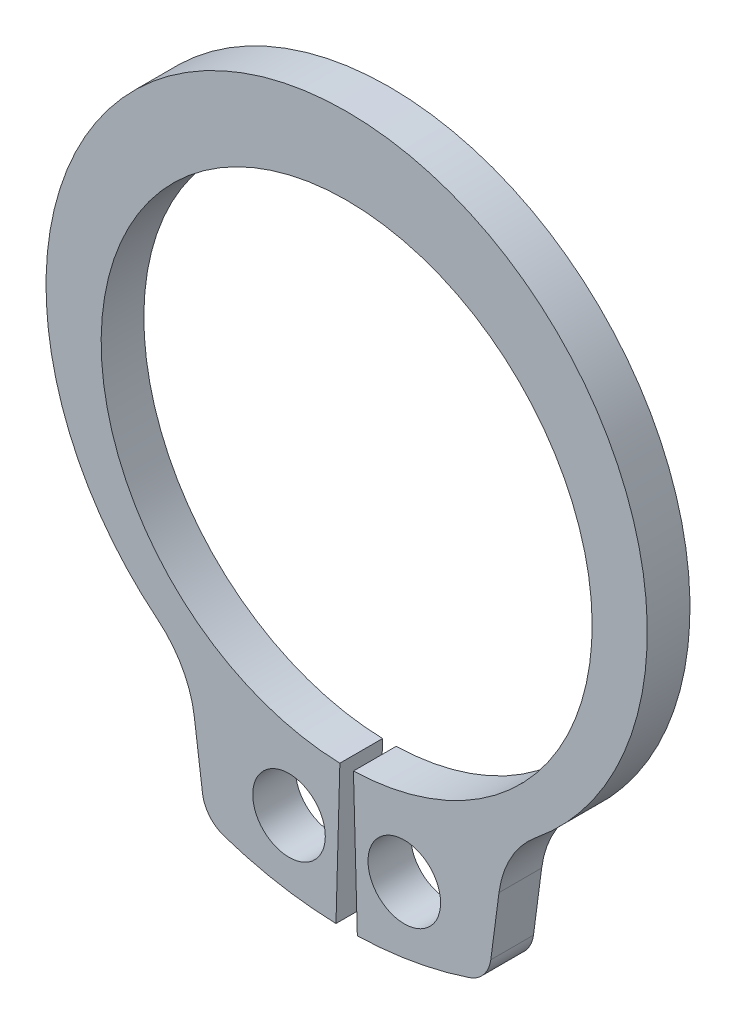
ISO-10303-21;
HEADER;
FILE_DESCRIPTION(('STEP AP214'),'2;1');
FILE_NAME('part.step','',(''),(''),'','','');
FILE_SCHEMA(('AUTOMOTIVE_DESIGN { 1 0 10303 214 1 1 1 1 }'));
ENDSEC;
DATA;
#1=APPLICATION_CONTEXT('core data for automotive mechanical design processes');
#2=APPLICATION_PROTOCOL_DEFINITION('international standard','automotive_design',2000,#1);
#3=PRODUCT_CONTEXT('',#1,'mechanical');
#4=PRODUCT('Part','Part','',(#3));
#5=PRODUCT_RELATED_PRODUCT_CATEGORY('part','',(#4));
#6=PRODUCT_DEFINITION_FORMATION('','',#4);
#7=PRODUCT_DEFINITION_CONTEXT('part definition',#1,'design');
#8=PRODUCT_DEFINITION('design','',#6,#7);
#9=PRODUCT_DEFINITION_SHAPE('','',#8);
#10=(LENGTH_UNIT() NAMED_UNIT(*) SI_UNIT(.MILLI.,.METRE.));
#11=(NAMED_UNIT(*) PLANE_ANGLE_UNIT() SI_UNIT($,.RADIAN.));
#12=(NAMED_UNIT(*) SI_UNIT($,.STERADIAN.) SOLID_ANGLE_UNIT());
#13=UNCERTAINTY_MEASURE_WITH_UNIT(LENGTH_MEASURE(1.E-05),#10,'distance_accuracy_value','');
#14=(GEOMETRIC_REPRESENTATION_CONTEXT(3) GLOBAL_UNCERTAINTY_ASSIGNED_CONTEXT((#13)) GLOBAL_UNIT_ASSIGNED_CONTEXT((#10,
#11,#12)) REPRESENTATION_CONTEXT('',''));
#15=CARTESIAN_POINT('',(0.,0.,0.));
#16=DIRECTION('',(0.,0.,1.));
#17=DIRECTION('',(1.,0.,0.));
#18=AXIS2_PLACEMENT_3D('',#15,#16,#17);
#19=CARTESIAN_POINT('',(0.,0.,-1.));
#20=DIRECTION('',(0.,0.,1.));
#21=DIRECTION('',(1.,0.,0.));
#22=AXIS2_PLACEMENT_3D('',#19,#20,#21);
#23=CYLINDRICAL_SURFACE('',#22,5.75);
#24=CARTESIAN_POINT('',(0.,0.,0.));
#25=DIRECTION('',(0.,0.,-1.));
#26=DIRECTION('',(1.,0.,0.));
#27=AXIS2_PLACEMENT_3D('',#24,#25,#26);
#28=CIRCLE('',#27,5.75);
#29=CARTESIAN_POINT('',(-0.158839779005525,-5.74780566169434,0.));
#30=VERTEX_POINT('',#29);
#31=CARTESIAN_POINT('',(0.158839779005525,-5.74780566169434,0.));
#32=VERTEX_POINT('',#31);
#33=EDGE_CURVE('E154',#30,#32,#28,.T.);
#34=ORIENTED_EDGE('',*,*,#33,.F.);
#35=DIRECTION('',(0.,0.,1.));
#36=VECTOR('',#35,1.);
#37=CARTESIAN_POINT('',(-0.158839779005525,-5.74780566169434,-1.));
#38=LINE('',#37,#36);
#39=CARTESIAN_POINT('',(-0.158839779005525,-5.74780566169434,-1.));
#40=VERTEX_POINT('',#39);
#41=EDGE_CURVE('E11',#40,#30,#38,.T.);
#42=ORIENTED_EDGE('',*,*,#41,.F.);
#43=CARTESIAN_POINT('',(0.,0.,-1.));
#44=DIRECTION('',(0.,0.,-1.));
#45=DIRECTION('',(1.,0.,0.));
#46=AXIS2_PLACEMENT_3D('',#43,#44,#45);
#47=CIRCLE('',#46,5.75);
#48=CARTESIAN_POINT('',(0.158839779005525,-5.74780566169434,-1.));
#49=VERTEX_POINT('',#48);
#50=EDGE_CURVE('E187',#40,#49,#47,.T.);
#51=ORIENTED_EDGE('',*,*,#50,.T.);
#52=DIRECTION('',(0.,0.,1.));
#53=VECTOR('',#52,1.);
#54=CARTESIAN_POINT('',(0.158839779005525,-5.74780566169434,-1.));
#55=LINE('',#54,#53);
#56=EDGE_CURVE('E36',#49,#32,#55,.T.);
#57=ORIENTED_EDGE('',*,*,#56,.T.);
#58=EDGE_LOOP('',(#34,#42,#51,#57));
#59=FACE_BOUND('',#58,.T.);
#60=ADVANCED_FACE('F33',(#59),#23,.F.);
#61=CARTESIAN_POINT('',(-0.158839779005525,-5.74780566169434,-1.));
#62=DIRECTION('',(0.999618375946841,-0.0276243093922652,0.));
#63=DIRECTION('',(0.0276243093922652,0.999618375946841,0.));
#64=AXIS2_PLACEMENT_3D('',#61,#62,#63);
#65=PLANE('',#64);
#66=DIRECTION('',(0.0276243093922652,0.999618375946841,0.));
#67=VECTOR('',#66,1.);
#68=CARTESIAN_POINT('',(-0.158839779005525,-5.74780566169434,0.));
#69=LINE('',#68,#67);
#70=CARTESIAN_POINT('',(-0.25,-9.04654630231891,0.));
#71=VERTEX_POINT('',#70);
#72=EDGE_CURVE('E185',#71,#30,#69,.T.);
#73=ORIENTED_EDGE('',*,*,#72,.F.);
#74=DIRECTION('',(0.,0.,1.));
#75=VECTOR('',#74,1.);
#76=CARTESIAN_POINT('',(-0.25,-9.04654630231891,-1.));
#77=LINE('',#76,#75);
#78=CARTESIAN_POINT('',(-0.25,-9.04654630231891,-1.));
#79=VERTEX_POINT('',#78);
#80=EDGE_CURVE('E42',#79,#71,#77,.T.);
#81=ORIENTED_EDGE('',*,*,#80,.F.);
#82=DIRECTION('',(0.0276243093922652,0.999618375946841,0.));
#83=VECTOR('',#82,1.);
#84=CARTESIAN_POINT('',(-0.158839779005525,-5.74780566169434,-1.));
#85=LINE('',#84,#83);
#86=EDGE_CURVE('E144',#79,#40,#85,.T.);
#87=ORIENTED_EDGE('',*,*,#86,.T.);
#88=ORIENTED_EDGE('',*,*,#41,.T.);
#89=EDGE_LOOP('',(#73,#81,#87,#88));
#90=FACE_BOUND('',#89,.T.);
#91=ADVANCED_FACE('F207',(#90),#65,.T.);
#92=CARTESIAN_POINT('',(0.,0.,-1.));
#93=DIRECTION('',(0.,0.,1.));
#94=DIRECTION('',(1.,0.,0.));
#95=AXIS2_PLACEMENT_3D('',#92,#93,#94);
#96=CYLINDRICAL_SURFACE('',#95,9.05);
#97=CARTESIAN_POINT('',(0.,0.,0.));
#98=DIRECTION('',(0.,0.,1.));
#99=DIRECTION('',(1.,0.,0.));
#100=AXIS2_PLACEMENT_3D('',#97,#98,#99);
#101=CIRCLE('',#100,9.05);
#102=CARTESIAN_POINT('',(-2.87007776682859,-8.5828406493629,0.));
#103=VERTEX_POINT('',#102);
#104=EDGE_CURVE('E131',#103,#71,#101,.T.);
#105=ORIENTED_EDGE('',*,*,#104,.F.);
#106=DIRECTION('',(0.,0.,1.));
#107=VECTOR('',#106,1.);
#108=CARTESIAN_POINT('',(-2.87007776682859,-8.5828406493629,-1.));
#109=LINE('',#108,#107);
#110=CARTESIAN_POINT('',(-2.87007776682859,-8.5828406493629,-1.));
#111=VERTEX_POINT('',#110);
#112=EDGE_CURVE('E126',#111,#103,#109,.T.);
#113=ORIENTED_EDGE('',*,*,#112,.F.);
#114=CARTESIAN_POINT('',(0.,0.,-1.));
#115=DIRECTION('',(0.,0.,1.));
#116=DIRECTION('',(1.,0.,0.));
#117=AXIS2_PLACEMENT_3D('',#114,#115,#116);
#118=CIRCLE('',#117,9.05);
#119=EDGE_CURVE('E129',#111,#79,#118,.T.);
#120=ORIENTED_EDGE('',*,*,#119,.T.);
#121=ORIENTED_EDGE('',*,*,#80,.T.);
#122=EDGE_LOOP('',(#105,#113,#120,#121));
#123=FACE_BOUND('',#122,.T.);
#124=ADVANCED_FACE('F128',(#123),#96,.T.);
#125=CARTESIAN_POINT('',(-2.63222601819639,-7.87155551267537,-1.));
#126=DIRECTION('',(0.,0.,1.));
#127=DIRECTION('',(1.,0.,0.));
#128=AXIS2_PLACEMENT_3D('',#125,#126,#127);
#129=CYLINDRICAL_SURFACE('',#128,0.749999999999999);
#130=CARTESIAN_POINT('',(-2.63222601819639,-7.87155551267537,0.));
#131=DIRECTION('',(0.,0.,1.));
#132=DIRECTION('',(1.,0.,0.));
#133=AXIS2_PLACEMENT_3D('',#130,#131,#132);
#134=CIRCLE('',#133,0.749999999999999);
#135=CARTESIAN_POINT('',(-3.37580966422674,-7.96945015684041,0.));
#136=VERTEX_POINT('',#135);
#137=EDGE_CURVE('E182',#136,#103,#134,.T.);
#138=ORIENTED_EDGE('',*,*,#137,.F.);
#139=DIRECTION('',(0.,0.,1.));
#140=VECTOR('',#139,1.);
#141=CARTESIAN_POINT('',(-3.37580966422674,-7.96945015684041,-1.));
#142=LINE('',#141,#140);
#143=CARTESIAN_POINT('',(-3.37580966422674,-7.96945015684041,-1.));
#144=VERTEX_POINT('',#143);
#145=EDGE_CURVE('E136',#144,#136,#142,.T.);
#146=ORIENTED_EDGE('',*,*,#145,.F.);
#147=CARTESIAN_POINT('',(-2.63222601819639,-7.87155551267537,-1.));
#148=DIRECTION('',(0.,0.,1.));
#149=DIRECTION('',(1.,0.,0.));
#150=AXIS2_PLACEMENT_3D('',#147,#148,#149);
#151=CIRCLE('',#150,0.749999999999999);
#152=EDGE_CURVE('E142',#144,#111,#151,.T.);
#153=ORIENTED_EDGE('',*,*,#152,.T.);
#154=ORIENTED_EDGE('',*,*,#112,.T.);
#155=EDGE_LOOP('',(#138,#146,#153,#154));
#156=FACE_BOUND('',#155,.T.);
#157=ADVANCED_FACE('F146',(#156),#129,.T.);
#158=CARTESIAN_POINT('',(-3.56793709135462,-6.51009746206657,-1.));
#159=DIRECTION('',(-0.99144486137381,-0.130526192220052,0.));
#160=DIRECTION('',(0.130526192220052,-0.99144486137381,0.));
#161=AXIS2_PLACEMENT_3D('',#158,#159,#160);
#162=PLANE('',#161);
#163=DIRECTION('',(0.130526192220052,-0.99144486137381,0.));
#164=VECTOR('',#163,1.);
#165=CARTESIAN_POINT('',(-3.56793709135462,-6.51009746206657,0.));
#166=LINE('',#165,#164);
#167=CARTESIAN_POINT('',(-3.56793709135462,-6.51009746206657,0.));
#168=VERTEX_POINT('',#167);
#169=EDGE_CURVE('E179',#168,#136,#166,.T.);
#170=ORIENTED_EDGE('',*,*,#169,.F.);
#171=DIRECTION('',(0.,0.,1.));
#172=VECTOR('',#171,1.);
#173=CARTESIAN_POINT('',(-3.56793709135462,-6.51009746206657,-1.));
#174=LINE('',#173,#172);
#175=CARTESIAN_POINT('',(-3.56793709135462,-6.51009746206657,-1.));
#176=VERTEX_POINT('',#175);
#177=EDGE_CURVE('E191',#176,#168,#174,.T.);
#178=ORIENTED_EDGE('',*,*,#177,.F.);
#179=DIRECTION('',(0.130526192220052,-0.99144486137381,0.));
#180=VECTOR('',#179,1.);
#181=CARTESIAN_POINT('',(-3.56793709135462,-6.51009746206657,-1.));
#182=LINE('',#181,#180);
#183=EDGE_CURVE('E147',#176,#144,#182,.T.);
#184=ORIENTED_EDGE('',*,*,#183,.T.);
#185=ORIENTED_EDGE('',*,*,#145,.T.);
#186=EDGE_LOOP('',(#170,#178,#184,#185));
#187=FACE_BOUND('',#186,.T.);
#188=ADVANCED_FACE('F220',(#187),#162,.T.);
#189=CARTESIAN_POINT('',(-5.94540544054401,-6.82309710817233,-1.));
#190=DIRECTION('',(0.,0.,1.));
#191=DIRECTION('',(1.,0.,0.));
#192=AXIS2_PLACEMENT_3D('',#189,#190,#191);
#193=CYLINDRICAL_SURFACE('',#192,2.39798342985511);
#194=CARTESIAN_POINT('',(-5.94540544054401,-6.82309710817233,0.));
#195=DIRECTION('',(0.,0.,-1.));
#196=DIRECTION('',(1.,0.,0.));
#197=AXIS2_PLACEMENT_3D('',#194,#195,#196);
#198=CIRCLE('',#197,2.39798342985511);
#199=CARTESIAN_POINT('',(-4.43503151096838,-4.96054640477714,0.));
#200=VERTEX_POINT('',#199);
#201=EDGE_CURVE('E176',#200,#168,#198,.T.);
#202=ORIENTED_EDGE('',*,*,#201,.F.);
#203=DIRECTION('',(0.,0.,1.));
#204=VECTOR('',#203,1.);
#205=CARTESIAN_POINT('',(-4.43503151096838,-4.96054640477714,-1.));
#206=LINE('',#205,#204);
#207=CARTESIAN_POINT('',(-4.43503151096838,-4.96054640477714,-1.));
#208=VERTEX_POINT('',#207);
#209=EDGE_CURVE('E193',#208,#200,#206,.T.);
#210=ORIENTED_EDGE('',*,*,#209,.F.);
#211=CARTESIAN_POINT('',(-5.94540544054401,-6.82309710817233,-1.));
#212=DIRECTION('',(0.,0.,-1.));
#213=DIRECTION('',(1.,0.,0.));
#214=AXIS2_PLACEMENT_3D('',#211,#212,#213);
#215=CIRCLE('',#214,2.39798342985511);
#216=EDGE_CURVE('E149',#208,#176,#215,.T.);
#217=ORIENTED_EDGE('',*,*,#216,.T.);
#218=ORIENTED_EDGE('',*,*,#177,.T.);
#219=EDGE_LOOP('',(#202,#210,#217,#218));
#220=FACE_BOUND('',#219,.T.);
#221=ADVANCED_FACE('F223',(#220),#193,.F.);
#222=CARTESIAN_POINT('',(0.,0.508609874062365,-1.));
#223=DIRECTION('',(0.,0.,1.));
#224=DIRECTION('',(1.,0.,0.));
#225=AXIS2_PLACEMENT_3D('',#222,#223,#224);
#226=CYLINDRICAL_SURFACE('',#225,7.04139012593764);
#227=CARTESIAN_POINT('',(0.,0.508609874062365,0.));
#228=DIRECTION('',(0.,0.,1.));
#229=DIRECTION('',(1.,0.,0.));
#230=AXIS2_PLACEMENT_3D('',#227,#228,#229);
#231=CIRCLE('',#230,7.04139012593764);
#232=CARTESIAN_POINT('',(4.43503151096838,-4.96054640477714,0.));
#233=VERTEX_POINT('',#232);
#234=EDGE_CURVE('E173',#233,#200,#231,.T.);
#235=ORIENTED_EDGE('',*,*,#234,.F.);
#236=DIRECTION('',(0.,0.,1.));
#237=VECTOR('',#236,1.);
#238=CARTESIAN_POINT('',(4.43503151096838,-4.96054640477714,-1.));
#239=LINE('',#238,#237);
#240=CARTESIAN_POINT('',(4.43503151096838,-4.96054640477714,-1.));
#241=VERTEX_POINT('',#240);
#242=EDGE_CURVE('E195',#241,#233,#239,.T.);
#243=ORIENTED_EDGE('',*,*,#242,.F.);
#244=CARTESIAN_POINT('',(0.,0.508609874062365,-1.));
#245=DIRECTION('',(0.,0.,1.));
#246=DIRECTION('',(1.,0.,0.));
#247=AXIS2_PLACEMENT_3D('',#244,#245,#246);
#248=CIRCLE('',#247,7.04139012593764);
#249=EDGE_CURVE('E297',#241,#208,#248,.T.);
#250=ORIENTED_EDGE('',*,*,#249,.T.);
#251=ORIENTED_EDGE('',*,*,#209,.T.);
#252=EDGE_LOOP('',(#235,#243,#250,#251));
#253=FACE_BOUND('',#252,.T.);
#254=ADVANCED_FACE('F227',(#253),#226,.T.);
#255=CARTESIAN_POINT('',(5.94540544054401,-6.82309710817233,-1.));
#256=DIRECTION('',(0.,0.,1.));
#257=DIRECTION('',(1.,0.,0.));
#258=AXIS2_PLACEMENT_3D('',#255,#256,#257);
#259=CYLINDRICAL_SURFACE('',#258,2.39798342985511);
#260=CARTESIAN_POINT('',(5.94540544054401,-6.82309710817233,0.));
#261=DIRECTION('',(0.,0.,-1.));
#262=DIRECTION('',(1.,0.,0.));
#263=AXIS2_PLACEMENT_3D('',#260,#261,#262);
#264=CIRCLE('',#263,2.39798342985511);
#265=CARTESIAN_POINT('',(3.56793709135462,-6.51009746206656,0.));
#266=VERTEX_POINT('',#265);
#267=EDGE_CURVE('E170',#266,#233,#264,.T.);
#268=ORIENTED_EDGE('',*,*,#267,.F.);
#269=DIRECTION('',(0.,0.,1.));
#270=VECTOR('',#269,1.);
#271=CARTESIAN_POINT('',(3.56793709135462,-6.51009746206656,-1.));
#272=LINE('',#271,#270);
#273=CARTESIAN_POINT('',(3.56793709135462,-6.51009746206656,-1.));
#274=VERTEX_POINT('',#273);
#275=EDGE_CURVE('E197',#274,#266,#272,.T.);
#276=ORIENTED_EDGE('',*,*,#275,.F.);
#277=CARTESIAN_POINT('',(5.94540544054401,-6.82309710817233,-1.));
#278=DIRECTION('',(0.,0.,-1.));
#279=DIRECTION('',(1.,0.,0.));
#280=AXIS2_PLACEMENT_3D('',#277,#278,#279);
#281=CIRCLE('',#280,2.39798342985511);
#282=EDGE_CURVE('E294',#274,#241,#281,.T.);
#283=ORIENTED_EDGE('',*,*,#282,.T.);
#284=ORIENTED_EDGE('',*,*,#242,.T.);
#285=EDGE_LOOP('',(#268,#276,#283,#284));
#286=FACE_BOUND('',#285,.T.);
#287=ADVANCED_FACE('F231',(#286),#259,.F.);
#288=CARTESIAN_POINT('',(3.56793709135462,-6.51009746206657,-1.));
#289=DIRECTION('',(0.99144486137381,-0.130526192220052,0.));
#290=DIRECTION('',(0.130526192220052,0.99144486137381,0.));
#291=AXIS2_PLACEMENT_3D('',#288,#289,#290);
#292=PLANE('',#291);
#293=DIRECTION('',(0.130526192220052,0.99144486137381,0.));
#294=VECTOR('',#293,1.);
#295=CARTESIAN_POINT('',(3.56793709135462,-6.51009746206657,0.));
#296=LINE('',#295,#294);
#297=CARTESIAN_POINT('',(3.37580966422674,-7.96945015684041,0.));
#298=VERTEX_POINT('',#297);
#299=EDGE_CURVE('E167',#298,#266,#296,.T.);
#300=ORIENTED_EDGE('',*,*,#299,.F.);
#301=DIRECTION('',(0.,0.,1.));
#302=VECTOR('',#301,1.);
#303=CARTESIAN_POINT('',(3.37580966422674,-7.96945015684041,-1.));
#304=LINE('',#303,#302);
#305=CARTESIAN_POINT('',(3.37580966422674,-7.96945015684041,-1.));
#306=VERTEX_POINT('',#305);
#307=EDGE_CURVE('E199',#306,#298,#304,.T.);
#308=ORIENTED_EDGE('',*,*,#307,.F.);
#309=DIRECTION('',(0.130526192220052,0.99144486137381,0.));
#310=VECTOR('',#309,1.);
#311=CARTESIAN_POINT('',(3.56793709135462,-6.51009746206657,-1.));
#312=LINE('',#311,#310);
#313=EDGE_CURVE('E291',#306,#274,#312,.T.);
#314=ORIENTED_EDGE('',*,*,#313,.T.);
#315=ORIENTED_EDGE('',*,*,#275,.T.);
#316=EDGE_LOOP('',(#300,#308,#314,#315));
#317=FACE_BOUND('',#316,.T.);
#318=ADVANCED_FACE('F235',(#317),#292,.T.);
#319=CARTESIAN_POINT('',(2.63222601819639,-7.87155551267537,-1.));
#320=DIRECTION('',(0.,0.,1.));
#321=DIRECTION('',(1.,0.,0.));
#322=AXIS2_PLACEMENT_3D('',#319,#320,#321);
#323=CYLINDRICAL_SURFACE('',#322,0.749999999999999);
#324=CARTESIAN_POINT('',(2.63222601819639,-7.87155551267537,0.));
#325=DIRECTION('',(0.,0.,1.));
#326=DIRECTION('',(-1.,0.,0.));
#327=AXIS2_PLACEMENT_3D('',#324,#325,#326);
#328=CIRCLE('',#327,0.749999999999999);
#329=CARTESIAN_POINT('',(2.87007776682859,-8.5828406493629,0.));
#330=VERTEX_POINT('',#329);
#331=EDGE_CURVE('E164',#330,#298,#328,.T.);
#332=ORIENTED_EDGE('',*,*,#331,.F.);
#333=DIRECTION('',(0.,0.,1.));
#334=VECTOR('',#333,1.);
#335=CARTESIAN_POINT('',(2.87007776682859,-8.5828406493629,-1.));
#336=LINE('',#335,#334);
#337=CARTESIAN_POINT('',(2.87007776682859,-8.5828406493629,-1.));
#338=VERTEX_POINT('',#337);
#339=EDGE_CURVE('E201',#338,#330,#336,.T.);
#340=ORIENTED_EDGE('',*,*,#339,.F.);
#341=CARTESIAN_POINT('',(2.63222601819639,-7.87155551267537,-1.));
#342=DIRECTION('',(0.,0.,1.));
#343=DIRECTION('',(-1.,0.,0.));
#344=AXIS2_PLACEMENT_3D('',#341,#342,#343);
#345=CIRCLE('',#344,0.749999999999999);
#346=EDGE_CURVE('E288',#338,#306,#345,.T.);
#347=ORIENTED_EDGE('',*,*,#346,.T.);
#348=ORIENTED_EDGE('',*,*,#307,.T.);
#349=EDGE_LOOP('',(#332,#340,#347,#348));
#350=FACE_BOUND('',#349,.T.);
#351=ADVANCED_FACE('F239',(#350),#323,.T.);
#352=CARTESIAN_POINT('',(0.,0.,-1.));
#353=DIRECTION('',(0.,0.,1.));
#354=DIRECTION('',(1.,0.,0.));
#355=AXIS2_PLACEMENT_3D('',#352,#353,#354);
#356=CYLINDRICAL_SURFACE('',#355,9.05);
#357=CARTESIAN_POINT('',(0.,0.,0.));
#358=DIRECTION('',(0.,0.,1.));
#359=DIRECTION('',(1.,0.,0.));
#360=AXIS2_PLACEMENT_3D('',#357,#358,#359);
#361=CIRCLE('',#360,9.05);
#362=CARTESIAN_POINT('',(0.249999999999998,-9.04654630231891,0.));
#363=VERTEX_POINT('',#362);
#364=EDGE_CURVE('E161',#363,#330,#361,.T.);
#365=ORIENTED_EDGE('',*,*,#364,.F.);
#366=DIRECTION('',(0.,0.,1.));
#367=VECTOR('',#366,1.);
#368=CARTESIAN_POINT('',(0.249999999999998,-9.04654630231891,-1.));
#369=LINE('',#368,#367);
#370=CARTESIAN_POINT('',(0.249999999999998,-9.04654630231891,-1.));
#371=VERTEX_POINT('',#370);
#372=EDGE_CURVE('E202',#371,#363,#369,.T.);
#373=ORIENTED_EDGE('',*,*,#372,.F.);
#374=CARTESIAN_POINT('',(0.,0.,-1.));
#375=DIRECTION('',(0.,0.,1.));
#376=DIRECTION('',(1.,0.,0.));
#377=AXIS2_PLACEMENT_3D('',#374,#375,#376);
#378=CIRCLE('',#377,9.05);
#379=EDGE_CURVE('E285',#371,#338,#378,.T.);
#380=ORIENTED_EDGE('',*,*,#379,.T.);
#381=ORIENTED_EDGE('',*,*,#339,.T.);
#382=EDGE_LOOP('',(#365,#373,#380,#381));
#383=FACE_BOUND('',#382,.T.);
#384=ADVANCED_FACE('F243',(#383),#356,.T.);
#385=CARTESIAN_POINT('',(0.158839779005525,-5.74780566169434,-1.));
#386=DIRECTION('',(-0.999618375946841,-0.0276243093922652,0.));
#387=DIRECTION('',(0.0276243093922652,-0.999618375946841,0.));
#388=AXIS2_PLACEMENT_3D('',#385,#386,#387);
#389=PLANE('',#388);
#390=DIRECTION('',(0.0276243093922652,-0.999618375946841,0.));
#391=VECTOR('',#390,1.);
#392=CARTESIAN_POINT('',(0.158839779005525,-5.74780566169434,0.));
#393=LINE('',#392,#391);
#394=EDGE_CURVE('E157',#32,#363,#393,.T.);
#395=ORIENTED_EDGE('',*,*,#394,.F.);
#396=ORIENTED_EDGE('',*,*,#56,.F.);
#397=DIRECTION('',(0.0276243093922652,-0.999618375946841,0.));
#398=VECTOR('',#397,1.);
#399=CARTESIAN_POINT('',(0.158839779005525,-5.74780566169434,-1.));
#400=LINE('',#399,#398);
#401=EDGE_CURVE('E283',#49,#371,#400,.T.);
#402=ORIENTED_EDGE('',*,*,#401,.T.);
#403=ORIENTED_EDGE('',*,*,#372,.T.);
#404=EDGE_LOOP('',(#395,#396,#402,#403));
#405=FACE_BOUND('',#404,.T.);
#406=ADVANCED_FACE('F204',(#405),#389,.T.);
#407=CARTESIAN_POINT('',(0.,0.,-1.));
#408=DIRECTION('',(0.,0.,1.));
#409=DIRECTION('',(1.,0.,0.));
#410=AXIS2_PLACEMENT_3D('',#407,#408,#409);
#411=PLANE('',#410);
#412=CARTESIAN_POINT('',(-1.35,-7.4029132778927,-1.));
#413=DIRECTION('',(0.,0.,1.));
#414=DIRECTION('',(1.,0.,0.));
#415=AXIS2_PLACEMENT_3D('',#412,#413,#414);
#416=CIRCLE('',#415,0.85);
#417=CARTESIAN_POINT('',(-0.5,-7.4029132778927,-1.));
#418=VERTEX_POINT('',#417);
#419=EDGE_CURVE('E270',#418,#418,#416,.T.);
#420=ORIENTED_EDGE('',*,*,#419,.T.);
#421=EDGE_LOOP('',(#420));
#422=FACE_BOUND('',#421,.T.);
#423=CARTESIAN_POINT('',(1.35,-7.4029132778927,-1.));
#424=DIRECTION('',(0.,0.,1.));
#425=DIRECTION('',(1.,0.,0.));
#426=AXIS2_PLACEMENT_3D('',#423,#424,#425);
#427=CIRCLE('',#426,0.85);
#428=CARTESIAN_POINT('',(2.2,-7.4029132778927,-1.));
#429=VERTEX_POINT('',#428);
#430=EDGE_CURVE('E158',#429,#429,#427,.T.);
#431=ORIENTED_EDGE('',*,*,#430,.T.);
#432=EDGE_LOOP('',(#431));
#433=FACE_BOUND('',#432,.T.);
#434=ORIENTED_EDGE('',*,*,#50,.F.);
#435=ORIENTED_EDGE('',*,*,#86,.F.);
#436=ORIENTED_EDGE('',*,*,#119,.F.);
#437=ORIENTED_EDGE('',*,*,#152,.F.);
#438=ORIENTED_EDGE('',*,*,#183,.F.);
#439=ORIENTED_EDGE('',*,*,#216,.F.);
#440=ORIENTED_EDGE('',*,*,#249,.F.);
#441=ORIENTED_EDGE('',*,*,#282,.F.);
#442=ORIENTED_EDGE('',*,*,#313,.F.);
#443=ORIENTED_EDGE('',*,*,#346,.F.);
#444=ORIENTED_EDGE('',*,*,#379,.F.);
#445=ORIENTED_EDGE('',*,*,#401,.F.);
#446=EDGE_LOOP('',(#434,#435,#436,#437,#438,#439,#440,#441,#442,#443,#444,#445));
#447=FACE_BOUND('',#446,.T.);
#448=ADVANCED_FACE('F140',(#422,#433,#447),#411,.F.);
#449=CARTESIAN_POINT('',(0.,0.,0.));
#450=DIRECTION('',(0.,0.,1.));
#451=DIRECTION('',(1.,0.,0.));
#452=AXIS2_PLACEMENT_3D('',#449,#450,#451);
#453=PLANE('',#452);
#454=CARTESIAN_POINT('',(-1.35,-7.4029132778927,0.));
#455=DIRECTION('',(0.,0.,1.));
#456=DIRECTION('',(1.,0.,0.));
#457=AXIS2_PLACEMENT_3D('',#454,#455,#456);
#458=CIRCLE('',#457,0.85);
#459=CARTESIAN_POINT('',(-0.5,-7.4029132778927,0.));
#460=VERTEX_POINT('',#459);
#461=EDGE_CURVE('E273',#460,#460,#458,.T.);
#462=ORIENTED_EDGE('',*,*,#461,.F.);
#463=EDGE_LOOP('',(#462));
#464=FACE_BOUND('',#463,.T.);
#465=CARTESIAN_POINT('',(1.35,-7.4029132778927,0.));
#466=DIRECTION('',(0.,0.,1.));
#467=DIRECTION('',(1.,0.,0.));
#468=AXIS2_PLACEMENT_3D('',#465,#466,#467);
#469=CIRCLE('',#468,0.85);
#470=CARTESIAN_POINT('',(2.2,-7.4029132778927,0.));
#471=VERTEX_POINT('',#470);
#472=EDGE_CURVE('E275',#471,#471,#469,.T.);
#473=ORIENTED_EDGE('',*,*,#472,.F.);
#474=EDGE_LOOP('',(#473));
#475=FACE_BOUND('',#474,.T.);
#476=ORIENTED_EDGE('',*,*,#33,.T.);
#477=ORIENTED_EDGE('',*,*,#394,.T.);
#478=ORIENTED_EDGE('',*,*,#364,.T.);
#479=ORIENTED_EDGE('',*,*,#331,.T.);
#480=ORIENTED_EDGE('',*,*,#299,.T.);
#481=ORIENTED_EDGE('',*,*,#267,.T.);
#482=ORIENTED_EDGE('',*,*,#234,.T.);
#483=ORIENTED_EDGE('',*,*,#201,.T.);
#484=ORIENTED_EDGE('',*,*,#169,.T.);
#485=ORIENTED_EDGE('',*,*,#137,.T.);
#486=ORIENTED_EDGE('',*,*,#104,.T.);
#487=ORIENTED_EDGE('',*,*,#72,.T.);
#488=EDGE_LOOP('',(#476,#477,#478,#479,#480,#481,#482,#483,#484,#485,#486,#487));
#489=FACE_BOUND('',#488,.T.);
#490=ADVANCED_FACE('F206',(#464,#475,#489),#453,.T.);
#491=CARTESIAN_POINT('',(1.35,-7.4029132778927,-1.));
#492=DIRECTION('',(0.,0.,1.));
#493=DIRECTION('',(1.,0.,0.));
#494=AXIS2_PLACEMENT_3D('',#491,#492,#493);
#495=CYLINDRICAL_SURFACE('',#494,0.85);
#496=ORIENTED_EDGE('',*,*,#430,.F.);
#497=EDGE_LOOP('',(#496));
#498=FACE_BOUND('',#497,.T.);
#499=ORIENTED_EDGE('',*,*,#472,.T.);
#500=EDGE_LOOP('',(#499));
#501=FACE_BOUND('',#500,.T.);
#502=ADVANCED_FACE('F255',(#498,#501),#495,.F.);
#503=CARTESIAN_POINT('',(-1.35,-7.4029132778927,-1.));
#504=DIRECTION('',(0.,0.,1.));
#505=DIRECTION('',(1.,0.,0.));
#506=AXIS2_PLACEMENT_3D('',#503,#504,#505);
#507=CYLINDRICAL_SURFACE('',#506,0.85);
#508=ORIENTED_EDGE('',*,*,#419,.F.);
#509=EDGE_LOOP('',(#508));
#510=FACE_BOUND('',#509,.T.);
#511=ORIENTED_EDGE('',*,*,#461,.T.);
#512=EDGE_LOOP('',(#511));
#513=FACE_BOUND('',#512,.T.);
#514=ADVANCED_FACE('F262',(#510,#513),#507,.F.);
#515=CLOSED_SHELL('',(#60,#91,#124,#157,#188,#221,#254,#287,#318,#351,#384,#406,#448,#490,#502,#514));
#516=MANIFOLD_SOLID_BREP('B2',#515);
#517=ADVANCED_BREP_SHAPE_REPRESENTATION('',(#18,#516),#14);
#518=SHAPE_DEFINITION_REPRESENTATION(#9,#517);
ENDSEC;
END-ISO-10303-21;
